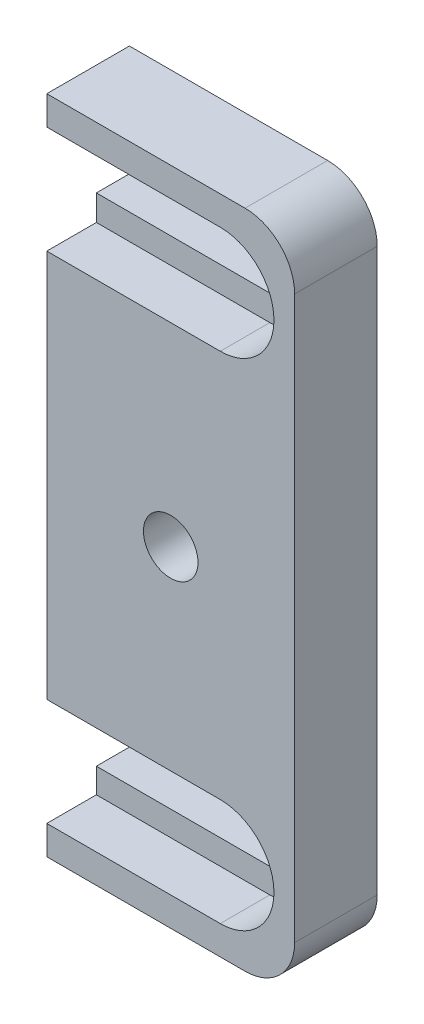
ISO-10303-21;
HEADER;
FILE_DESCRIPTION(('STEP AP214'),'2;1');
FILE_NAME('part.step','',(''),(''),'','','');
FILE_SCHEMA(('AUTOMOTIVE_DESIGN { 1 0 10303 214 1 1 1 1 }'));
ENDSEC;
DATA;
#1=APPLICATION_CONTEXT('core data for automotive mechanical design processes');
#2=APPLICATION_PROTOCOL_DEFINITION('international standard','automotive_design',2000,#1);
#3=PRODUCT_CONTEXT('',#1,'mechanical');
#4=PRODUCT('Part','Part','',(#3));
#5=PRODUCT_RELATED_PRODUCT_CATEGORY('part','',(#4));
#6=PRODUCT_DEFINITION_FORMATION('','',#4);
#7=PRODUCT_DEFINITION_CONTEXT('part definition',#1,'design');
#8=PRODUCT_DEFINITION('design','',#6,#7);
#9=PRODUCT_DEFINITION_SHAPE('','',#8);
#10=(LENGTH_UNIT() NAMED_UNIT(*) SI_UNIT(.MILLI.,.METRE.));
#11=(NAMED_UNIT(*) PLANE_ANGLE_UNIT() SI_UNIT($,.RADIAN.));
#12=(NAMED_UNIT(*) SI_UNIT($,.STERADIAN.) SOLID_ANGLE_UNIT());
#13=UNCERTAINTY_MEASURE_WITH_UNIT(LENGTH_MEASURE(1.E-05),#10,'distance_accuracy_value','');
#14=(GEOMETRIC_REPRESENTATION_CONTEXT(3) GLOBAL_UNCERTAINTY_ASSIGNED_CONTEXT((#13)) GLOBAL_UNIT_ASSIGNED_CONTEXT((#10,
#11,#12)) REPRESENTATION_CONTEXT('',''));
#15=CARTESIAN_POINT('',(0.,0.,0.));
#16=DIRECTION('',(0.,0.,1.));
#17=DIRECTION('',(1.,0.,0.));
#18=AXIS2_PLACEMENT_3D('',#15,#16,#17);
#19=CARTESIAN_POINT('',(0.,0.,0.));
#20=DIRECTION('',(-1.,0.,0.));
#21=DIRECTION('',(0.,-1.,0.));
#22=AXIS2_PLACEMENT_3D('',#19,#20,#21);
#23=PLANE('',#22);
#24=DIRECTION('',(0.,0.,-1.));
#25=VECTOR('',#24,1.);
#26=CARTESIAN_POINT('',(0.,-36.7500000000001,5.));
#27=LINE('',#26,#25);
#28=CARTESIAN_POINT('',(0.,-36.7500000000001,2.));
#29=VERTEX_POINT('',#28);
#30=CARTESIAN_POINT('',(0.,-36.7500000000001,0.));
#31=VERTEX_POINT('',#30);
#32=EDGE_CURVE('E186',#29,#31,#27,.T.);
#33=ORIENTED_EDGE('',*,*,#32,.T.);
#34=DIRECTION('',(0.,-1.,0.));
#35=VECTOR('',#34,1.);
#36=CARTESIAN_POINT('',(0.,0.,0.));
#37=LINE('',#36,#35);
#38=CARTESIAN_POINT('',(0.,-40.,0.));
#39=VERTEX_POINT('',#38);
#40=EDGE_CURVE('E199',#31,#39,#37,.T.);
#41=ORIENTED_EDGE('',*,*,#40,.T.);
#42=DIRECTION('',(0.,0.,1.));
#43=VECTOR('',#42,1.);
#44=CARTESIAN_POINT('',(0.,-40.,0.));
#45=LINE('',#44,#43);
#46=CARTESIAN_POINT('',(0.,-40.,5.));
#47=VERTEX_POINT('',#46);
#48=EDGE_CURVE('E228',#39,#47,#45,.T.);
#49=ORIENTED_EDGE('',*,*,#48,.T.);
#50=DIRECTION('',(0.,-1.,0.));
#51=VECTOR('',#50,1.);
#52=CARTESIAN_POINT('',(0.,0.,5.));
#53=LINE('',#52,#51);
#54=CARTESIAN_POINT('',(0.,-38.25,5.));
#55=VERTEX_POINT('',#54);
#56=EDGE_CURVE('E237',#55,#47,#53,.T.);
#57=ORIENTED_EDGE('',*,*,#56,.F.);
#58=DIRECTION('',(0.,0.,1.));
#59=VECTOR('',#58,1.);
#60=CARTESIAN_POINT('',(0.,-38.25,2.));
#61=LINE('',#60,#59);
#62=CARTESIAN_POINT('',(0.,-38.25,2.));
#63=VERTEX_POINT('',#62);
#64=EDGE_CURVE('E311',#63,#55,#61,.T.);
#65=ORIENTED_EDGE('',*,*,#64,.F.);
#66=DIRECTION('',(0.,-1.,0.));
#67=VECTOR('',#66,1.);
#68=CARTESIAN_POINT('',(0.,-31.7500000000001,2.));
#69=LINE('',#68,#67);
#70=EDGE_CURVE('E202',#29,#63,#69,.T.);
#71=ORIENTED_EDGE('',*,*,#70,.F.);
#72=EDGE_LOOP('',(#33,#41,#49,#57,#65,#71));
#73=FACE_BOUND('',#72,.T.);
#74=ADVANCED_FACE('F35',(#73),#23,.T.);
#75=DIRECTION('',(0.,0.,1.));
#76=VECTOR('',#75,1.);
#77=CARTESIAN_POINT('',(0.,-3.3,0.));
#78=LINE('',#77,#76);
#79=CARTESIAN_POINT('',(0.,-3.3,0.));
#80=VERTEX_POINT('',#79);
#81=CARTESIAN_POINT('',(0.,-3.3,2.));
#82=VERTEX_POINT('',#81);
#83=EDGE_CURVE('E323',#80,#82,#78,.T.);
#84=ORIENTED_EDGE('',*,*,#83,.T.);
#85=DIRECTION('',(0.,-1.,0.));
#86=VECTOR('',#85,1.);
#87=CARTESIAN_POINT('',(0.,-1.75,2.));
#88=LINE('',#87,#86);
#89=CARTESIAN_POINT('',(0.,-1.75,2.));
#90=VERTEX_POINT('',#89);
#91=EDGE_CURVE('E336',#90,#82,#88,.T.);
#92=ORIENTED_EDGE('',*,*,#91,.F.);
#93=DIRECTION('',(0.,0.,1.));
#94=VECTOR('',#93,1.);
#95=CARTESIAN_POINT('',(0.,-1.75,2.));
#96=LINE('',#95,#94);
#97=CARTESIAN_POINT('',(0.,-1.75,5.));
#98=VERTEX_POINT('',#97);
#99=EDGE_CURVE('E235',#90,#98,#96,.T.);
#100=ORIENTED_EDGE('',*,*,#99,.T.);
#101=CARTESIAN_POINT('',(0.,0.,5.));
#102=VERTEX_POINT('',#101);
#103=EDGE_CURVE('E238',#102,#98,#53,.T.);
#104=ORIENTED_EDGE('',*,*,#103,.F.);
#105=DIRECTION('',(0.,0.,1.));
#106=VECTOR('',#105,1.);
#107=CARTESIAN_POINT('',(0.,0.,0.));
#108=LINE('',#107,#106);
#109=CARTESIAN_POINT('',(0.,0.,0.));
#110=VERTEX_POINT('',#109);
#111=EDGE_CURVE('E223',#110,#102,#108,.T.);
#112=ORIENTED_EDGE('',*,*,#111,.F.);
#113=EDGE_CURVE('E213',#110,#80,#37,.T.);
#114=ORIENTED_EDGE('',*,*,#113,.T.);
#115=EDGE_LOOP('',(#84,#92,#100,#104,#112,#114));
#116=FACE_BOUND('',#115,.T.);
#117=ADVANCED_FACE('F368',(#116),#23,.T.);
#118=CARTESIAN_POINT('',(15.,-40.,0.));
#119=DIRECTION('',(1.,0.,0.));
#120=DIRECTION('',(0.,0.,-1.));
#121=AXIS2_PLACEMENT_3D('',#118,#119,#120);
#122=PLANE('',#121);
#123=DIRECTION('',(0.,1.,0.));
#124=VECTOR('',#123,1.);
#125=CARTESIAN_POINT('',(15.,-40.,5.));
#126=LINE('',#125,#124);
#127=CARTESIAN_POINT('',(15.,-37.,5.));
#128=VERTEX_POINT('',#127);
#129=CARTESIAN_POINT('',(15.,-3.,5.));
#130=VERTEX_POINT('',#129);
#131=EDGE_CURVE('E231',#128,#130,#126,.T.);
#132=ORIENTED_EDGE('',*,*,#131,.F.);
#133=DIRECTION('',(0.,0.,1.));
#134=VECTOR('',#133,1.);
#135=CARTESIAN_POINT('',(15.,-37.,0.));
#136=LINE('',#135,#134);
#137=CARTESIAN_POINT('',(15.,-37.,0.));
#138=VERTEX_POINT('',#137);
#139=EDGE_CURVE('E262',#128,#138,#136,.F.);
#140=ORIENTED_EDGE('',*,*,#139,.T.);
#141=DIRECTION('',(0.,1.,0.));
#142=VECTOR('',#141,1.);
#143=CARTESIAN_POINT('',(15.,-40.,0.));
#144=LINE('',#143,#142);
#145=CARTESIAN_POINT('',(15.,-3.,0.));
#146=VERTEX_POINT('',#145);
#147=EDGE_CURVE('E215',#138,#146,#144,.T.);
#148=ORIENTED_EDGE('',*,*,#147,.T.);
#149=DIRECTION('',(0.,0.,1.));
#150=VECTOR('',#149,1.);
#151=CARTESIAN_POINT('',(15.,-3.,0.));
#152=LINE('',#151,#150);
#153=EDGE_CURVE('E259',#146,#130,#152,.T.);
#154=ORIENTED_EDGE('',*,*,#153,.T.);
#155=EDGE_LOOP('',(#132,#140,#148,#154));
#156=FACE_BOUND('',#155,.T.);
#157=ADVANCED_FACE('F364',(#156),#122,.T.);
#158=CARTESIAN_POINT('',(0.,-40.,0.));
#159=DIRECTION('',(0.,-1.,0.));
#160=DIRECTION('',(1.,0.,0.));
#161=AXIS2_PLACEMENT_3D('',#158,#159,#160);
#162=PLANE('',#161);
#163=DIRECTION('',(1.,0.,0.));
#164=VECTOR('',#163,1.);
#165=CARTESIAN_POINT('',(0.,-40.,0.));
#166=LINE('',#165,#164);
#167=CARTESIAN_POINT('',(12.,-40.,0.));
#168=VERTEX_POINT('',#167);
#169=EDGE_CURVE('E209',#39,#168,#166,.T.);
#170=ORIENTED_EDGE('',*,*,#169,.T.);
#171=DIRECTION('',(0.,0.,1.));
#172=VECTOR('',#171,1.);
#173=CARTESIAN_POINT('',(12.,-40.,0.));
#174=LINE('',#173,#172);
#175=CARTESIAN_POINT('',(12.,-40.,5.));
#176=VERTEX_POINT('',#175);
#177=EDGE_CURVE('E253',#168,#176,#174,.T.);
#178=ORIENTED_EDGE('',*,*,#177,.T.);
#179=DIRECTION('',(1.,0.,0.));
#180=VECTOR('',#179,1.);
#181=CARTESIAN_POINT('',(0.,-40.,5.));
#182=LINE('',#181,#180);
#183=EDGE_CURVE('E241',#47,#176,#182,.T.);
#184=ORIENTED_EDGE('',*,*,#183,.F.);
#185=ORIENTED_EDGE('',*,*,#48,.F.);
#186=EDGE_LOOP('',(#170,#178,#184,#185));
#187=FACE_BOUND('',#186,.T.);
#188=ADVANCED_FACE('F269',(#187),#162,.T.);
#189=DIRECTION('',(0.,0.,-1.));
#190=VECTOR('',#189,1.);
#191=CARTESIAN_POINT('',(0.,-33.25,5.));
#192=LINE('',#191,#190);
#193=CARTESIAN_POINT('',(0.,-33.25,2.));
#194=VERTEX_POINT('',#193);
#195=CARTESIAN_POINT('',(0.,-33.25,0.));
#196=VERTEX_POINT('',#195);
#197=EDGE_CURVE('E203',#194,#196,#192,.T.);
#198=ORIENTED_EDGE('',*,*,#197,.F.);
#199=CARTESIAN_POINT('',(0.,-31.7500000000001,2.));
#200=VERTEX_POINT('',#199);
#201=EDGE_CURVE('E296',#200,#194,#69,.T.);
#202=ORIENTED_EDGE('',*,*,#201,.F.);
#203=DIRECTION('',(0.,0.,1.));
#204=VECTOR('',#203,1.);
#205=CARTESIAN_POINT('',(0.,-31.7500000000001,2.));
#206=LINE('',#205,#204);
#207=CARTESIAN_POINT('',(0.,-31.7500000000001,5.));
#208=VERTEX_POINT('',#207);
#209=EDGE_CURVE('E294',#200,#208,#206,.T.);
#210=ORIENTED_EDGE('',*,*,#209,.T.);
#211=CARTESIAN_POINT('',(0.,-8.25,5.));
#212=VERTEX_POINT('',#211);
#213=EDGE_CURVE('E242',#212,#208,#53,.T.);
#214=ORIENTED_EDGE('',*,*,#213,.F.);
#215=DIRECTION('',(0.,0.,1.));
#216=VECTOR('',#215,1.);
#217=CARTESIAN_POINT('',(0.,-8.25,2.));
#218=LINE('',#217,#216);
#219=CARTESIAN_POINT('',(0.,-8.25,2.));
#220=VERTEX_POINT('',#219);
#221=EDGE_CURVE('E292',#220,#212,#218,.T.);
#222=ORIENTED_EDGE('',*,*,#221,.F.);
#223=CARTESIAN_POINT('',(0.,-6.7,2.));
#224=VERTEX_POINT('',#223);
#225=EDGE_CURVE('E340',#224,#220,#88,.T.);
#226=ORIENTED_EDGE('',*,*,#225,.F.);
#227=DIRECTION('',(0.,0.,1.));
#228=VECTOR('',#227,1.);
#229=CARTESIAN_POINT('',(0.,-6.7,0.));
#230=LINE('',#229,#228);
#231=CARTESIAN_POINT('',(0.,-6.7,0.));
#232=VERTEX_POINT('',#231);
#233=EDGE_CURVE('E333',#232,#224,#230,.T.);
#234=ORIENTED_EDGE('',*,*,#233,.F.);
#235=EDGE_CURVE('E210',#232,#196,#37,.T.);
#236=ORIENTED_EDGE('',*,*,#235,.T.);
#237=EDGE_LOOP('',(#198,#202,#210,#214,#222,#226,#234,#236));
#238=FACE_BOUND('',#237,.T.);
#239=ADVANCED_FACE('F290',(#238),#23,.T.);
#240=CARTESIAN_POINT('',(15.,0.,0.));
#241=DIRECTION('',(0.,1.,0.));
#242=DIRECTION('',(0.,0.,1.));
#243=AXIS2_PLACEMENT_3D('',#240,#241,#242);
#244=PLANE('',#243);
#245=DIRECTION('',(-1.,0.,0.));
#246=VECTOR('',#245,1.);
#247=CARTESIAN_POINT('',(15.,0.,5.));
#248=LINE('',#247,#246);
#249=CARTESIAN_POINT('',(12.,0.,5.));
#250=VERTEX_POINT('',#249);
#251=EDGE_CURVE('E234',#250,#102,#248,.T.);
#252=ORIENTED_EDGE('',*,*,#251,.F.);
#253=DIRECTION('',(0.,0.,1.));
#254=VECTOR('',#253,1.);
#255=CARTESIAN_POINT('',(12.,0.,0.));
#256=LINE('',#255,#254);
#257=CARTESIAN_POINT('',(12.,0.,0.));
#258=VERTEX_POINT('',#257);
#259=EDGE_CURVE('E11',#250,#258,#256,.F.);
#260=ORIENTED_EDGE('',*,*,#259,.T.);
#261=DIRECTION('',(-1.,0.,0.));
#262=VECTOR('',#261,1.);
#263=CARTESIAN_POINT('',(15.,0.,0.));
#264=LINE('',#263,#262);
#265=EDGE_CURVE('E211',#258,#110,#264,.T.);
#266=ORIENTED_EDGE('',*,*,#265,.T.);
#267=ORIENTED_EDGE('',*,*,#111,.T.);
#268=EDGE_LOOP('',(#252,#260,#266,#267));
#269=FACE_BOUND('',#268,.T.);
#270=ADVANCED_FACE('F366',(#269),#244,.T.);
#271=CARTESIAN_POINT('',(0.,0.,0.));
#272=DIRECTION('',(0.,0.,1.));
#273=DIRECTION('',(1.,0.,0.));
#274=AXIS2_PLACEMENT_3D('',#271,#272,#273);
#275=PLANE('',#274);
#276=CARTESIAN_POINT('',(7.50000000000001,-20.,0.));
#277=DIRECTION('',(0.,0.,1.));
#278=DIRECTION('',(1.,0.,0.));
#279=AXIS2_PLACEMENT_3D('',#276,#277,#278);
#280=CIRCLE('',#279,1.65);
#281=CARTESIAN_POINT('',(9.15000000000001,-20.,0.));
#282=VERTEX_POINT('',#281);
#283=EDGE_CURVE('E194',#282,#282,#280,.T.);
#284=ORIENTED_EDGE('',*,*,#283,.T.);
#285=EDGE_LOOP('',(#284));
#286=FACE_BOUND('',#285,.T.);
#287=ORIENTED_EDGE('',*,*,#147,.F.);
#288=CARTESIAN_POINT('',(12.,-37.,0.));
#289=DIRECTION('',(0.,0.,1.));
#290=DIRECTION('',(1.,0.,0.));
#291=AXIS2_PLACEMENT_3D('',#288,#289,#290);
#292=CIRCLE('',#291,3.);
#293=EDGE_CURVE('E43',#138,#168,#292,.F.);
#294=ORIENTED_EDGE('',*,*,#293,.T.);
#295=ORIENTED_EDGE('',*,*,#169,.F.);
#296=ORIENTED_EDGE('',*,*,#40,.F.);
#297=DIRECTION('',(-1.,0.,0.));
#298=VECTOR('',#297,1.);
#299=CARTESIAN_POINT('',(10.5,-36.7500000000001,0.));
#300=LINE('',#299,#298);
#301=CARTESIAN_POINT('',(10.5,-36.7500000000001,0.));
#302=VERTEX_POINT('',#301);
#303=EDGE_CURVE('E183',#302,#31,#300,.T.);
#304=ORIENTED_EDGE('',*,*,#303,.F.);
#305=CARTESIAN_POINT('',(10.5,-35.,0.));
#306=DIRECTION('',(0.,0.,-1.));
#307=DIRECTION('',(-1.,0.,0.));
#308=AXIS2_PLACEMENT_3D('',#305,#306,#307);
#309=CIRCLE('',#308,1.75000000000003);
#310=CARTESIAN_POINT('',(10.5,-33.25,0.));
#311=VERTEX_POINT('',#310);
#312=EDGE_CURVE('E204',#311,#302,#309,.T.);
#313=ORIENTED_EDGE('',*,*,#312,.F.);
#314=DIRECTION('',(1.,0.,0.));
#315=VECTOR('',#314,1.);
#316=CARTESIAN_POINT('',(0.,-33.25,0.));
#317=LINE('',#316,#315);
#318=EDGE_CURVE('E193',#196,#311,#317,.T.);
#319=ORIENTED_EDGE('',*,*,#318,.F.);
#320=ORIENTED_EDGE('',*,*,#235,.F.);
#321=DIRECTION('',(1.,0.,0.));
#322=VECTOR('',#321,1.);
#323=CARTESIAN_POINT('',(0.,-6.7,0.));
#324=LINE('',#323,#322);
#325=CARTESIAN_POINT('',(10.5,-6.7,0.));
#326=VERTEX_POINT('',#325);
#327=EDGE_CURVE('E317',#232,#326,#324,.T.);
#328=ORIENTED_EDGE('',*,*,#327,.T.);
#329=CARTESIAN_POINT('',(10.5,-5.,0.));
#330=DIRECTION('',(0.,0.,1.));
#331=DIRECTION('',(1.,0.,0.));
#332=AXIS2_PLACEMENT_3D('',#329,#330,#331);
#333=CIRCLE('',#332,1.7);
#334=CARTESIAN_POINT('',(10.5,-3.30000000000001,0.));
#335=VERTEX_POINT('',#334);
#336=EDGE_CURVE('E321',#326,#335,#333,.T.);
#337=ORIENTED_EDGE('',*,*,#336,.T.);
#338=DIRECTION('',(-1.,0.,0.));
#339=VECTOR('',#338,1.);
#340=CARTESIAN_POINT('',(10.5,-3.3,0.));
#341=LINE('',#340,#339);
#342=EDGE_CURVE('E314',#335,#80,#341,.T.);
#343=ORIENTED_EDGE('',*,*,#342,.T.);
#344=ORIENTED_EDGE('',*,*,#113,.F.);
#345=ORIENTED_EDGE('',*,*,#265,.F.);
#346=CARTESIAN_POINT('',(12.,-3.,0.));
#347=DIRECTION('',(0.,0.,1.));
#348=DIRECTION('',(1.,0.,0.));
#349=AXIS2_PLACEMENT_3D('',#346,#347,#348);
#350=CIRCLE('',#349,3.);
#351=EDGE_CURVE('E55',#258,#146,#350,.F.);
#352=ORIENTED_EDGE('',*,*,#351,.T.);
#353=EDGE_LOOP('',(#287,#294,#295,#296,#304,#313,#319,#320,#328,#337,#343,#344,#345,#352));
#354=FACE_BOUND('',#353,.T.);
#355=ADVANCED_FACE('F207',(#286,#354),#275,.F.);
#356=CARTESIAN_POINT('',(0.,0.,5.));
#357=DIRECTION('',(0.,0.,1.));
#358=DIRECTION('',(1.,0.,0.));
#359=AXIS2_PLACEMENT_3D('',#356,#357,#358);
#360=PLANE('',#359);
#361=CARTESIAN_POINT('',(7.50000000000001,-20.,5.));
#362=DIRECTION('',(0.,0.,1.));
#363=DIRECTION('',(1.,0.,0.));
#364=AXIS2_PLACEMENT_3D('',#361,#362,#363);
#365=CIRCLE('',#364,1.65);
#366=CARTESIAN_POINT('',(9.15000000000001,-20.,5.));
#367=VERTEX_POINT('',#366);
#368=EDGE_CURVE('E495',#367,#367,#365,.T.);
#369=ORIENTED_EDGE('',*,*,#368,.F.);
#370=EDGE_LOOP('',(#369));
#371=FACE_BOUND('',#370,.T.);
#372=ORIENTED_EDGE('',*,*,#183,.T.);
#373=CARTESIAN_POINT('',(12.,-37.,5.));
#374=DIRECTION('',(0.,0.,1.));
#375=DIRECTION('',(1.,0.,0.));
#376=AXIS2_PLACEMENT_3D('',#373,#374,#375);
#377=CIRCLE('',#376,3.);
#378=EDGE_CURVE('E257',#176,#128,#377,.T.);
#379=ORIENTED_EDGE('',*,*,#378,.T.);
#380=ORIENTED_EDGE('',*,*,#131,.T.);
#381=CARTESIAN_POINT('',(12.,-3.,5.));
#382=DIRECTION('',(0.,0.,1.));
#383=DIRECTION('',(1.,0.,0.));
#384=AXIS2_PLACEMENT_3D('',#381,#382,#383);
#385=CIRCLE('',#384,3.);
#386=EDGE_CURVE('E255',#130,#250,#385,.T.);
#387=ORIENTED_EDGE('',*,*,#386,.T.);
#388=ORIENTED_EDGE('',*,*,#251,.T.);
#389=ORIENTED_EDGE('',*,*,#103,.T.);
#390=DIRECTION('',(-1.,0.,0.));
#391=VECTOR('',#390,1.);
#392=CARTESIAN_POINT('',(10.5,-1.75,5.));
#393=LINE('',#392,#391);
#394=CARTESIAN_POINT('',(10.5,-1.75000000000001,5.));
#395=VERTEX_POINT('',#394);
#396=EDGE_CURVE('E353',#395,#98,#393,.T.);
#397=ORIENTED_EDGE('',*,*,#396,.F.);
#398=CARTESIAN_POINT('',(10.5,-5.,5.));
#399=DIRECTION('',(0.,0.,1.));
#400=DIRECTION('',(1.,0.,0.));
#401=AXIS2_PLACEMENT_3D('',#398,#399,#400);
#402=CIRCLE('',#401,3.25);
#403=CARTESIAN_POINT('',(10.5,-8.25,5.));
#404=VERTEX_POINT('',#403);
#405=EDGE_CURVE('E350',#404,#395,#402,.T.);
#406=ORIENTED_EDGE('',*,*,#405,.F.);
#407=DIRECTION('',(1.,0.,0.));
#408=VECTOR('',#407,1.);
#409=CARTESIAN_POINT('',(0.,-8.25,5.));
#410=LINE('',#409,#408);
#411=EDGE_CURVE('E285',#212,#404,#410,.T.);
#412=ORIENTED_EDGE('',*,*,#411,.F.);
#413=ORIENTED_EDGE('',*,*,#213,.T.);
#414=DIRECTION('',(-1.,0.,0.));
#415=VECTOR('',#414,1.);
#416=CARTESIAN_POINT('',(10.5,-31.7500000000001,5.));
#417=LINE('',#416,#415);
#418=CARTESIAN_POINT('',(10.5,-31.7500000000001,5.));
#419=VERTEX_POINT('',#418);
#420=EDGE_CURVE('E282',#419,#208,#417,.T.);
#421=ORIENTED_EDGE('',*,*,#420,.F.);
#422=CARTESIAN_POINT('',(10.5,-35.,5.));
#423=DIRECTION('',(0.,0.,1.));
#424=DIRECTION('',(1.,0.,0.));
#425=AXIS2_PLACEMENT_3D('',#422,#423,#424);
#426=CIRCLE('',#425,3.24999999999998);
#427=CARTESIAN_POINT('',(10.5,-38.25,5.));
#428=VERTEX_POINT('',#427);
#429=EDGE_CURVE('E407',#428,#419,#426,.T.);
#430=ORIENTED_EDGE('',*,*,#429,.F.);
#431=DIRECTION('',(1.,0.,0.));
#432=VECTOR('',#431,1.);
#433=CARTESIAN_POINT('',(0.,-38.25,5.));
#434=LINE('',#433,#432);
#435=EDGE_CURVE('E277',#55,#428,#434,.T.);
#436=ORIENTED_EDGE('',*,*,#435,.F.);
#437=ORIENTED_EDGE('',*,*,#56,.T.);
#438=EDGE_LOOP('',(#372,#379,#380,#387,#388,#389,#397,#406,#412,#413,#421,#430,#436,#437));
#439=FACE_BOUND('',#438,.T.);
#440=ADVANCED_FACE('F271',(#371,#439),#360,.T.);
#441=CARTESIAN_POINT('',(10.5,-1.75,2.));
#442=DIRECTION('',(0.,1.,0.));
#443=DIRECTION('',(-1.,0.,0.));
#444=AXIS2_PLACEMENT_3D('',#441,#442,#443);
#445=PLANE('',#444);
#446=ORIENTED_EDGE('',*,*,#396,.T.);
#447=ORIENTED_EDGE('',*,*,#99,.F.);
#448=DIRECTION('',(-1.,0.,0.));
#449=VECTOR('',#448,1.);
#450=CARTESIAN_POINT('',(10.5,-1.75,2.));
#451=LINE('',#450,#449);
#452=CARTESIAN_POINT('',(10.5,-1.75000000000001,2.));
#453=VERTEX_POINT('',#452);
#454=EDGE_CURVE('E346',#453,#90,#451,.T.);
#455=ORIENTED_EDGE('',*,*,#454,.F.);
#456=DIRECTION('',(0.,0.,1.));
#457=VECTOR('',#456,1.);
#458=CARTESIAN_POINT('',(10.5,-1.75000000000001,2.));
#459=LINE('',#458,#457);
#460=EDGE_CURVE('E357',#453,#395,#459,.T.);
#461=ORIENTED_EDGE('',*,*,#460,.T.);
#462=EDGE_LOOP('',(#446,#447,#455,#461));
#463=FACE_BOUND('',#462,.T.);
#464=ADVANCED_FACE('F372',(#463),#445,.F.);
#465=CARTESIAN_POINT('',(10.5,-5.,2.));
#466=DIRECTION('',(0.,0.,1.));
#467=DIRECTION('',(1.,0.,0.));
#468=AXIS2_PLACEMENT_3D('',#465,#466,#467);
#469=CYLINDRICAL_SURFACE('',#468,3.25);
#470=ORIENTED_EDGE('',*,*,#405,.T.);
#471=ORIENTED_EDGE('',*,*,#460,.F.);
#472=CARTESIAN_POINT('',(10.5,-5.,2.));
#473=DIRECTION('',(0.,0.,1.));
#474=DIRECTION('',(1.,0.,0.));
#475=AXIS2_PLACEMENT_3D('',#472,#473,#474);
#476=CIRCLE('',#475,3.25);
#477=CARTESIAN_POINT('',(10.5,-8.25,2.));
#478=VERTEX_POINT('',#477);
#479=EDGE_CURVE('E343',#478,#453,#476,.T.);
#480=ORIENTED_EDGE('',*,*,#479,.F.);
#481=DIRECTION('',(0.,0.,1.));
#482=VECTOR('',#481,1.);
#483=CARTESIAN_POINT('',(10.5,-8.25,2.));
#484=LINE('',#483,#482);
#485=EDGE_CURVE('E359',#478,#404,#484,.T.);
#486=ORIENTED_EDGE('',*,*,#485,.T.);
#487=EDGE_LOOP('',(#470,#471,#480,#486));
#488=FACE_BOUND('',#487,.T.);
#489=ADVANCED_FACE('F376',(#488),#469,.F.);
#490=CARTESIAN_POINT('',(0.,-8.25,2.));
#491=DIRECTION('',(0.,-1.,0.));
#492=DIRECTION('',(0.,0.,-1.));
#493=AXIS2_PLACEMENT_3D('',#490,#491,#492);
#494=PLANE('',#493);
#495=ORIENTED_EDGE('',*,*,#411,.T.);
#496=ORIENTED_EDGE('',*,*,#485,.F.);
#497=DIRECTION('',(1.,0.,0.));
#498=VECTOR('',#497,1.);
#499=CARTESIAN_POINT('',(0.,-8.25,2.));
#500=LINE('',#499,#498);
#501=EDGE_CURVE('E339',#220,#478,#500,.T.);
#502=ORIENTED_EDGE('',*,*,#501,.F.);
#503=ORIENTED_EDGE('',*,*,#221,.T.);
#504=EDGE_LOOP('',(#495,#496,#502,#503));
#505=FACE_BOUND('',#504,.T.);
#506=ADVANCED_FACE('F379',(#505),#494,.F.);
#507=CARTESIAN_POINT('',(10.5,-5.,2.));
#508=DIRECTION('',(0.,0.,1.));
#509=DIRECTION('',(1.,0.,0.));
#510=AXIS2_PLACEMENT_3D('',#507,#508,#509);
#511=PLANE('',#510);
#512=DIRECTION('',(-1.,0.,0.));
#513=VECTOR('',#512,1.);
#514=CARTESIAN_POINT('',(10.5,-3.3,2.));
#515=LINE('',#514,#513);
#516=CARTESIAN_POINT('',(10.5,-3.30000000000001,2.));
#517=VERTEX_POINT('',#516);
#518=EDGE_CURVE('E300',#517,#82,#515,.T.);
#519=ORIENTED_EDGE('',*,*,#518,.F.);
#520=CARTESIAN_POINT('',(10.5,-5.,2.));
#521=DIRECTION('',(0.,0.,1.));
#522=DIRECTION('',(1.,0.,0.));
#523=AXIS2_PLACEMENT_3D('',#520,#521,#522);
#524=CIRCLE('',#523,1.7);
#525=CARTESIAN_POINT('',(10.5,-6.7,2.));
#526=VERTEX_POINT('',#525);
#527=EDGE_CURVE('E318',#526,#517,#524,.T.);
#528=ORIENTED_EDGE('',*,*,#527,.F.);
#529=DIRECTION('',(1.,0.,0.));
#530=VECTOR('',#529,1.);
#531=CARTESIAN_POINT('',(0.,-6.7,2.));
#532=LINE('',#531,#530);
#533=EDGE_CURVE('E303',#224,#526,#532,.T.);
#534=ORIENTED_EDGE('',*,*,#533,.F.);
#535=ORIENTED_EDGE('',*,*,#225,.T.);
#536=ORIENTED_EDGE('',*,*,#501,.T.);
#537=ORIENTED_EDGE('',*,*,#479,.T.);
#538=ORIENTED_EDGE('',*,*,#454,.T.);
#539=ORIENTED_EDGE('',*,*,#91,.T.);
#540=EDGE_LOOP('',(#519,#528,#534,#535,#536,#537,#538,#539));
#541=FACE_BOUND('',#540,.T.);
#542=ADVANCED_FACE('F382',(#541),#511,.T.);
#543=CARTESIAN_POINT('',(10.5,-3.3,0.));
#544=DIRECTION('',(0.,1.,0.));
#545=DIRECTION('',(-1.,0.,0.));
#546=AXIS2_PLACEMENT_3D('',#543,#544,#545);
#547=PLANE('',#546);
#548=ORIENTED_EDGE('',*,*,#518,.T.);
#549=ORIENTED_EDGE('',*,*,#83,.F.);
#550=ORIENTED_EDGE('',*,*,#342,.F.);
#551=DIRECTION('',(0.,0.,1.));
#552=VECTOR('',#551,1.);
#553=CARTESIAN_POINT('',(10.5,-3.30000000000001,0.));
#554=LINE('',#553,#552);
#555=EDGE_CURVE('E329',#335,#517,#554,.T.);
#556=ORIENTED_EDGE('',*,*,#555,.T.);
#557=EDGE_LOOP('',(#548,#549,#550,#556));
#558=FACE_BOUND('',#557,.T.);
#559=ADVANCED_FACE('F461',(#558),#547,.F.);
#560=CARTESIAN_POINT('',(10.5,-5.,0.));
#561=DIRECTION('',(0.,0.,1.));
#562=DIRECTION('',(1.,0.,0.));
#563=AXIS2_PLACEMENT_3D('',#560,#561,#562);
#564=CYLINDRICAL_SURFACE('',#563,1.7);
#565=ORIENTED_EDGE('',*,*,#527,.T.);
#566=ORIENTED_EDGE('',*,*,#555,.F.);
#567=ORIENTED_EDGE('',*,*,#336,.F.);
#568=DIRECTION('',(0.,0.,1.));
#569=VECTOR('',#568,1.);
#570=CARTESIAN_POINT('',(10.5,-6.7,0.));
#571=LINE('',#570,#569);
#572=EDGE_CURVE('E331',#326,#526,#571,.T.);
#573=ORIENTED_EDGE('',*,*,#572,.T.);
#574=EDGE_LOOP('',(#565,#566,#567,#573));
#575=FACE_BOUND('',#574,.T.);
#576=ADVANCED_FACE('F427',(#575),#564,.F.);
#577=CARTESIAN_POINT('',(0.,-6.7,0.));
#578=DIRECTION('',(0.,-1.,0.));
#579=DIRECTION('',(1.,0.,0.));
#580=AXIS2_PLACEMENT_3D('',#577,#578,#579);
#581=PLANE('',#580);
#582=ORIENTED_EDGE('',*,*,#533,.T.);
#583=ORIENTED_EDGE('',*,*,#572,.F.);
#584=ORIENTED_EDGE('',*,*,#327,.F.);
#585=ORIENTED_EDGE('',*,*,#233,.T.);
#586=EDGE_LOOP('',(#582,#583,#584,#585));
#587=FACE_BOUND('',#586,.T.);
#588=ADVANCED_FACE('F420',(#587),#581,.F.);
#589=CARTESIAN_POINT('',(10.5,-31.7500000000001,2.));
#590=DIRECTION('',(0.,1.,0.));
#591=DIRECTION('',(0.,0.,1.));
#592=AXIS2_PLACEMENT_3D('',#589,#590,#591);
#593=PLANE('',#592);
#594=ORIENTED_EDGE('',*,*,#420,.T.);
#595=ORIENTED_EDGE('',*,*,#209,.F.);
#596=DIRECTION('',(-1.,0.,0.));
#597=VECTOR('',#596,1.);
#598=CARTESIAN_POINT('',(10.5,-31.7500000000001,2.));
#599=LINE('',#598,#597);
#600=CARTESIAN_POINT('',(10.5,-31.7500000000001,2.));
#601=VERTEX_POINT('',#600);
#602=EDGE_CURVE('E313',#601,#200,#599,.T.);
#603=ORIENTED_EDGE('',*,*,#602,.F.);
#604=DIRECTION('',(0.,0.,1.));
#605=VECTOR('',#604,1.);
#606=CARTESIAN_POINT('',(10.5,-31.7500000000001,2.));
#607=LINE('',#606,#605);
#608=EDGE_CURVE('E301',#601,#419,#607,.T.);
#609=ORIENTED_EDGE('',*,*,#608,.T.);
#610=EDGE_LOOP('',(#594,#595,#603,#609));
#611=FACE_BOUND('',#610,.T.);
#612=ADVANCED_FACE('F418',(#611),#593,.F.);
#613=CARTESIAN_POINT('',(10.5,-35.,2.));
#614=DIRECTION('',(0.,0.,1.));
#615=DIRECTION('',(1.,0.,0.));
#616=AXIS2_PLACEMENT_3D('',#613,#614,#615);
#617=CYLINDRICAL_SURFACE('',#616,3.24999999999998);
#618=ORIENTED_EDGE('',*,*,#429,.T.);
#619=ORIENTED_EDGE('',*,*,#608,.F.);
#620=CARTESIAN_POINT('',(10.5,-35.,2.));
#621=DIRECTION('',(0.,0.,1.));
#622=DIRECTION('',(1.,0.,0.));
#623=AXIS2_PLACEMENT_3D('',#620,#621,#622);
#624=CIRCLE('',#623,3.24999999999998);
#625=CARTESIAN_POINT('',(10.5,-38.25,2.));
#626=VERTEX_POINT('',#625);
#627=EDGE_CURVE('E403',#626,#601,#624,.T.);
#628=ORIENTED_EDGE('',*,*,#627,.F.);
#629=DIRECTION('',(0.,0.,1.));
#630=VECTOR('',#629,1.);
#631=CARTESIAN_POINT('',(10.5,-38.25,2.));
#632=LINE('',#631,#630);
#633=EDGE_CURVE('E305',#626,#428,#632,.T.);
#634=ORIENTED_EDGE('',*,*,#633,.T.);
#635=EDGE_LOOP('',(#618,#619,#628,#634));
#636=FACE_BOUND('',#635,.T.);
#637=ADVANCED_FACE('F417',(#636),#617,.F.);
#638=CARTESIAN_POINT('',(0.,-38.25,2.));
#639=DIRECTION('',(0.,-1.,0.));
#640=DIRECTION('',(0.,0.,-1.));
#641=AXIS2_PLACEMENT_3D('',#638,#639,#640);
#642=PLANE('',#641);
#643=ORIENTED_EDGE('',*,*,#435,.T.);
#644=ORIENTED_EDGE('',*,*,#633,.F.);
#645=DIRECTION('',(1.,0.,0.));
#646=VECTOR('',#645,1.);
#647=CARTESIAN_POINT('',(0.,-38.25,2.));
#648=LINE('',#647,#646);
#649=EDGE_CURVE('E400',#63,#626,#648,.T.);
#650=ORIENTED_EDGE('',*,*,#649,.F.);
#651=ORIENTED_EDGE('',*,*,#64,.T.);
#652=EDGE_LOOP('',(#643,#644,#650,#651));
#653=FACE_BOUND('',#652,.T.);
#654=ADVANCED_FACE('F415',(#653),#642,.F.);
#655=CARTESIAN_POINT('',(10.5,-35.,2.));
#656=DIRECTION('',(0.,0.,1.));
#657=DIRECTION('',(1.,0.,0.));
#658=AXIS2_PLACEMENT_3D('',#655,#656,#657);
#659=PLANE('',#658);
#660=DIRECTION('',(1.,0.,0.));
#661=VECTOR('',#660,1.);
#662=CARTESIAN_POINT('',(10.5,-36.7500000000001,2.));
#663=LINE('',#662,#661);
#664=CARTESIAN_POINT('',(10.5,-36.7500000000001,2.));
#665=VERTEX_POINT('',#664);
#666=EDGE_CURVE('E251',#29,#665,#663,.T.);
#667=ORIENTED_EDGE('',*,*,#666,.F.);
#668=ORIENTED_EDGE('',*,*,#70,.T.);
#669=ORIENTED_EDGE('',*,*,#649,.T.);
#670=ORIENTED_EDGE('',*,*,#627,.T.);
#671=ORIENTED_EDGE('',*,*,#602,.T.);
#672=ORIENTED_EDGE('',*,*,#201,.T.);
#673=DIRECTION('',(-1.,0.,0.));
#674=VECTOR('',#673,1.);
#675=CARTESIAN_POINT('',(10.5,-33.25,2.));
#676=LINE('',#675,#674);
#677=CARTESIAN_POINT('',(10.5,-33.25,2.));
#678=VERTEX_POINT('',#677);
#679=EDGE_CURVE('E245',#678,#194,#676,.T.);
#680=ORIENTED_EDGE('',*,*,#679,.F.);
#681=CARTESIAN_POINT('',(10.5,-35.,2.));
#682=DIRECTION('',(0.,0.,1.));
#683=DIRECTION('',(1.,0.,0.));
#684=AXIS2_PLACEMENT_3D('',#681,#682,#683);
#685=CIRCLE('',#684,1.75000000000003);
#686=EDGE_CURVE('E248',#665,#678,#685,.T.);
#687=ORIENTED_EDGE('',*,*,#686,.F.);
#688=EDGE_LOOP('',(#667,#668,#669,#670,#671,#672,#680,#687));
#689=FACE_BOUND('',#688,.T.);
#690=ADVANCED_FACE('F412',(#689),#659,.T.);
#691=CARTESIAN_POINT('',(10.5,-36.7500000000001,5.));
#692=DIRECTION('',(0.,-1.,0.));
#693=DIRECTION('',(0.,0.,-1.));
#694=AXIS2_PLACEMENT_3D('',#691,#692,#693);
#695=PLANE('',#694);
#696=ORIENTED_EDGE('',*,*,#666,.T.);
#697=DIRECTION('',(0.,0.,-1.));
#698=VECTOR('',#697,1.);
#699=CARTESIAN_POINT('',(10.5,-36.7500000000001,5.));
#700=LINE('',#699,#698);
#701=EDGE_CURVE('E189',#665,#302,#700,.T.);
#702=ORIENTED_EDGE('',*,*,#701,.T.);
#703=ORIENTED_EDGE('',*,*,#303,.T.);
#704=ORIENTED_EDGE('',*,*,#32,.F.);
#705=EDGE_LOOP('',(#696,#702,#703,#704));
#706=FACE_BOUND('',#705,.T.);
#707=ADVANCED_FACE('F185',(#706),#695,.F.);
#708=CARTESIAN_POINT('',(10.5,-35.,5.));
#709=DIRECTION('',(0.,0.,-1.));
#710=DIRECTION('',(-1.,0.,0.));
#711=AXIS2_PLACEMENT_3D('',#708,#709,#710);
#712=CYLINDRICAL_SURFACE('',#711,1.75000000000003);
#713=ORIENTED_EDGE('',*,*,#686,.T.);
#714=DIRECTION('',(0.,0.,-1.));
#715=VECTOR('',#714,1.);
#716=CARTESIAN_POINT('',(10.5,-33.25,5.));
#717=LINE('',#716,#715);
#718=EDGE_CURVE('E396',#678,#311,#717,.T.);
#719=ORIENTED_EDGE('',*,*,#718,.T.);
#720=ORIENTED_EDGE('',*,*,#312,.T.);
#721=ORIENTED_EDGE('',*,*,#701,.F.);
#722=EDGE_LOOP('',(#713,#719,#720,#721));
#723=FACE_BOUND('',#722,.T.);
#724=ADVANCED_FACE('F475',(#723),#712,.F.);
#725=CARTESIAN_POINT('',(0.,-33.25,5.));
#726=DIRECTION('',(0.,1.,0.));
#727=DIRECTION('',(0.,0.,1.));
#728=AXIS2_PLACEMENT_3D('',#725,#726,#727);
#729=PLANE('',#728);
#730=ORIENTED_EDGE('',*,*,#679,.T.);
#731=ORIENTED_EDGE('',*,*,#197,.T.);
#732=ORIENTED_EDGE('',*,*,#318,.T.);
#733=ORIENTED_EDGE('',*,*,#718,.F.);
#734=EDGE_LOOP('',(#730,#731,#732,#733));
#735=FACE_BOUND('',#734,.T.);
#736=ADVANCED_FACE('F478',(#735),#729,.F.);
#737=CARTESIAN_POINT('',(7.50000000000001,-20.,5.));
#738=DIRECTION('',(0.,0.,1.));
#739=DIRECTION('',(1.,0.,0.));
#740=AXIS2_PLACEMENT_3D('',#737,#738,#739);
#741=CYLINDRICAL_SURFACE('',#740,1.65);
#742=ORIENTED_EDGE('',*,*,#283,.F.);
#743=EDGE_LOOP('',(#742));
#744=FACE_BOUND('',#743,.T.);
#745=ORIENTED_EDGE('',*,*,#368,.T.);
#746=EDGE_LOOP('',(#745));
#747=FACE_BOUND('',#746,.T.);
#748=ADVANCED_FACE('F481',(#744,#747),#741,.F.);
#749=CARTESIAN_POINT('',(12.,-37.,0.));
#750=DIRECTION('',(0.,0.,1.));
#751=DIRECTION('',(1.,0.,0.));
#752=AXIS2_PLACEMENT_3D('',#749,#750,#751);
#753=CYLINDRICAL_SURFACE('',#752,3.);
#754=ORIENTED_EDGE('',*,*,#293,.F.);
#755=ORIENTED_EDGE('',*,*,#139,.F.);
#756=ORIENTED_EDGE('',*,*,#378,.F.);
#757=ORIENTED_EDGE('',*,*,#177,.F.);
#758=EDGE_LOOP('',(#754,#755,#756,#757));
#759=FACE_BOUND('',#758,.T.);
#760=ADVANCED_FACE('F267',(#759),#753,.T.);
#761=CARTESIAN_POINT('',(12.,-3.,0.));
#762=DIRECTION('',(0.,0.,1.));
#763=DIRECTION('',(1.,0.,0.));
#764=AXIS2_PLACEMENT_3D('',#761,#762,#763);
#765=CYLINDRICAL_SURFACE('',#764,3.);
#766=ORIENTED_EDGE('',*,*,#351,.F.);
#767=ORIENTED_EDGE('',*,*,#259,.F.);
#768=ORIENTED_EDGE('',*,*,#386,.F.);
#769=ORIENTED_EDGE('',*,*,#153,.F.);
#770=EDGE_LOOP('',(#766,#767,#768,#769));
#771=FACE_BOUND('',#770,.T.);
#772=ADVANCED_FACE('F37',(#771),#765,.T.);
#773=CLOSED_SHELL('',(#74,#117,#157,#188,#239,#270,#355,#440,#464,#489,#506,#542,#559,#576,#588,
#612,#637,#654,#690,#707,#724,#736,#748,#760,#772));
#774=MANIFOLD_SOLID_BREP('B2',#773);
#775=ADVANCED_BREP_SHAPE_REPRESENTATION('',(#18,#774),#14);
#776=SHAPE_DEFINITION_REPRESENTATION(#9,#775);
ENDSEC;
END-ISO-10303-21;
